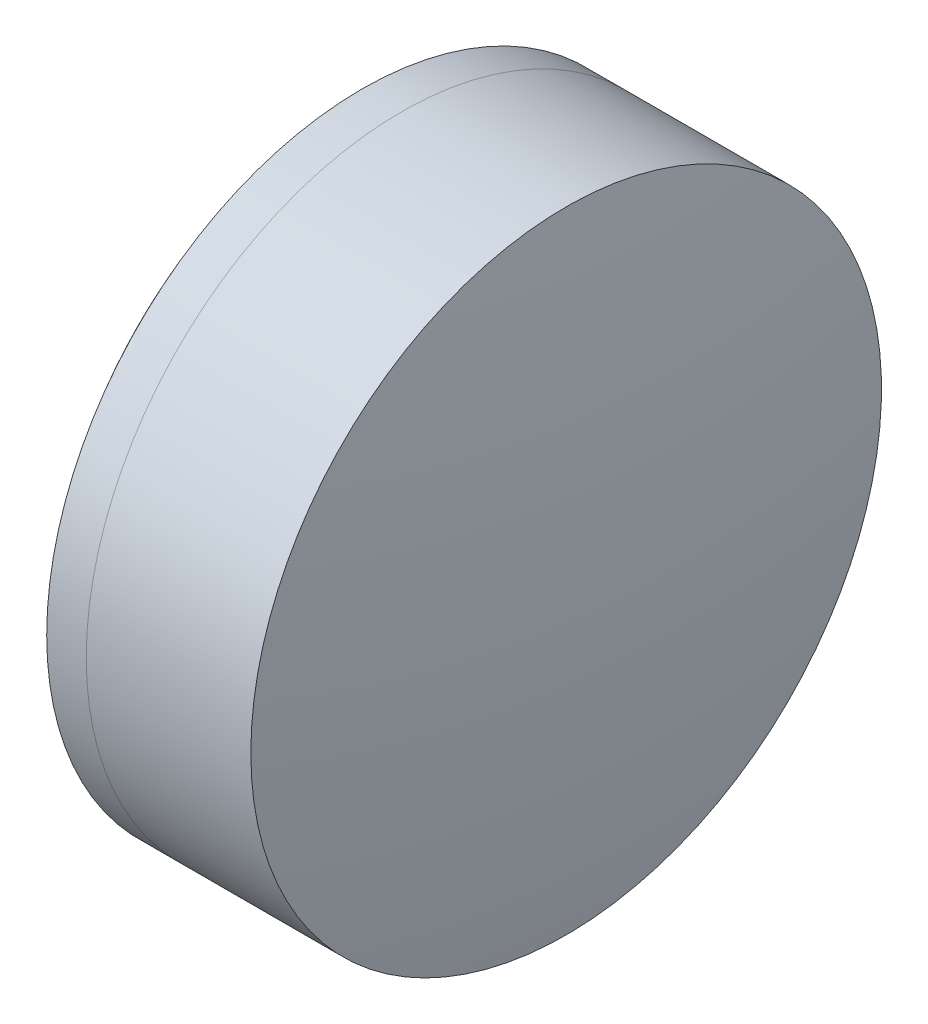
ISO-10303-21;
HEADER;
FILE_DESCRIPTION(('STEP AP214'),'2;1');
FILE_NAME('part.step','',(''),(''),'','','');
FILE_SCHEMA(('AUTOMOTIVE_DESIGN { 1 0 10303 214 1 1 1 1 }'));
ENDSEC;
DATA;
#1=APPLICATION_CONTEXT('core data for automotive mechanical design processes');
#2=APPLICATION_PROTOCOL_DEFINITION('international standard','automotive_design',2000,#1);
#3=PRODUCT_CONTEXT('',#1,'mechanical');
#4=PRODUCT('Part','Part','',(#3));
#5=PRODUCT_RELATED_PRODUCT_CATEGORY('part','',(#4));
#6=PRODUCT_DEFINITION_FORMATION('','',#4);
#7=PRODUCT_DEFINITION_CONTEXT('part definition',#1,'design');
#8=PRODUCT_DEFINITION('design','',#6,#7);
#9=PRODUCT_DEFINITION_SHAPE('','',#8);
#10=(LENGTH_UNIT() NAMED_UNIT(*) SI_UNIT(.MILLI.,.METRE.));
#11=(NAMED_UNIT(*) PLANE_ANGLE_UNIT() SI_UNIT($,.RADIAN.));
#12=(NAMED_UNIT(*) SI_UNIT($,.STERADIAN.) SOLID_ANGLE_UNIT());
#13=UNCERTAINTY_MEASURE_WITH_UNIT(LENGTH_MEASURE(1.E-05),#10,'distance_accuracy_value','');
#14=(GEOMETRIC_REPRESENTATION_CONTEXT(3) GLOBAL_UNCERTAINTY_ASSIGNED_CONTEXT((#13)) GLOBAL_UNIT_ASSIGNED_CONTEXT((#10,
#11,#12)) REPRESENTATION_CONTEXT('',''));
#15=CARTESIAN_POINT('',(0.,0.,0.));
#16=DIRECTION('',(0.,0.,1.));
#17=DIRECTION('',(1.,0.,0.));
#18=AXIS2_PLACEMENT_3D('',#15,#16,#17);
#19=CARTESIAN_POINT('',(264.478986554565,0.,0.));
#20=DIRECTION('',(-1.,0.,0.));
#21=DIRECTION('',(0.,0.,1.));
#22=AXIS2_PLACEMENT_3D('',#19,#20,#21);
#23=SPHERICAL_SURFACE('',#22,16.18);
#24=CARTESIAN_POINT('',(274.504075082853,0.,0.));
#25=DIRECTION('',(-1.,0.,0.));
#26=DIRECTION('',(0.,0.,1.));
#27=AXIS2_PLACEMENT_3D('',#24,#25,#26);
#28=CIRCLE('',#27,12.7);
#29=CARTESIAN_POINT('',(274.504075082853,0.,12.7));
#30=VERTEX_POINT('',#29);
#31=EDGE_CURVE('E11',#30,#30,#28,.T.);
#32=ORIENTED_EDGE('',*,*,#31,.T.);
#33=EDGE_LOOP('',(#32));
#34=FACE_BOUND('',#33,.T.);
#35=ADVANCED_FACE('F45',(#34),#23,.F.);
#36=CARTESIAN_POINT('',(-0.551919992657797,0.,0.));
#37=DIRECTION('',(-1.,0.,0.));
#38=DIRECTION('',(0.,0.,1.));
#39=AXIS2_PLACEMENT_3D('',#36,#37,#38);
#40=CYLINDRICAL_SURFACE('',#39,12.7);
#41=CARTESIAN_POINT('',(281.132534840341,0.,0.));
#42=DIRECTION('',(-1.,0.,0.));
#43=DIRECTION('',(0.,0.,1.));
#44=AXIS2_PLACEMENT_3D('',#41,#42,#43);
#45=CIRCLE('',#44,12.7);
#46=CARTESIAN_POINT('',(281.132534840341,0.,12.7));
#47=VERTEX_POINT('',#46);
#48=EDGE_CURVE('E51',#47,#47,#45,.T.);
#49=ORIENTED_EDGE('',*,*,#48,.T.);
#50=EDGE_LOOP('',(#49));
#51=FACE_BOUND('',#50,.T.);
#52=ORIENTED_EDGE('',*,*,#31,.F.);
#53=EDGE_LOOP('',(#52));
#54=FACE_BOUND('',#53,.T.);
#55=ADVANCED_FACE('F57',(#51,#54),#40,.T.);
#56=CARTESIAN_POINT('',(203.078986554565,0.,0.));
#57=DIRECTION('',(-1.,0.,0.));
#58=DIRECTION('',(0.,0.,1.));
#59=AXIS2_PLACEMENT_3D('',#56,#57,#58);
#60=SPHERICAL_SURFACE('',#59,79.08);
#61=ORIENTED_EDGE('',*,*,#48,.F.);
#62=EDGE_LOOP('',(#61));
#63=FACE_BOUND('',#62,.T.);
#64=ADVANCED_FACE('F60',(#63),#60,.T.);
#65=CLOSED_SHELL('',(#35,#55,#64));
#66=MANIFOLD_SOLID_BREP('B2',#65);
#67=CARTESIAN_POINT('',(289.748986554565,0.,0.));
#68=DIRECTION('',(-1.,0.,0.));
#69=DIRECTION('',(0.,0.,-1.));
#70=AXIS2_PLACEMENT_3D('',#67,#68,#69);
#71=SPHERICAL_SURFACE('',#70,21.09);
#72=CARTESIAN_POINT('',(272.911584735995,0.,0.));
#73=DIRECTION('',(-1.,0.,0.));
#74=DIRECTION('',(0.,0.,1.));
#75=AXIS2_PLACEMENT_3D('',#72,#73,#74);
#76=CIRCLE('',#75,12.7);
#77=CARTESIAN_POINT('',(272.911584735995,0.,12.7));
#78=VERTEX_POINT('',#77);
#79=EDGE_CURVE('E44',#78,#78,#76,.T.);
#80=ORIENTED_EDGE('',*,*,#79,.T.);
#81=EDGE_LOOP('',(#80));
#82=FACE_BOUND('',#81,.T.);
#83=ADVANCED_FACE('F86',(#82),#71,.T.);
#84=CARTESIAN_POINT('',(124.523309526045,0.,0.));
#85=DIRECTION('',(-1.,0.,0.));
#86=DIRECTION('',(0.,0.,1.));
#87=AXIS2_PLACEMENT_3D('',#84,#85,#86);
#88=CYLINDRICAL_SURFACE('',#87,12.7);
#89=CARTESIAN_POINT('',(274.504075082853,0.,0.));
#90=DIRECTION('',(-1.,0.,0.));
#91=DIRECTION('',(0.,0.,1.));
#92=AXIS2_PLACEMENT_3D('',#89,#90,#91);
#93=CIRCLE('',#92,12.7);
#94=CARTESIAN_POINT('',(274.504075082853,0.,12.7));
#95=VERTEX_POINT('',#94);
#96=EDGE_CURVE('E92',#95,#95,#93,.T.);
#97=ORIENTED_EDGE('',*,*,#96,.T.);
#98=EDGE_LOOP('',(#97));
#99=FACE_BOUND('',#98,.T.);
#100=ORIENTED_EDGE('',*,*,#79,.F.);
#101=EDGE_LOOP('',(#100));
#102=FACE_BOUND('',#101,.T.);
#103=ADVANCED_FACE('F98',(#99,#102),#88,.T.);
#104=CARTESIAN_POINT('',(264.478986554565,0.,0.));
#105=DIRECTION('',(-1.,0.,0.));
#106=DIRECTION('',(0.,0.,1.));
#107=AXIS2_PLACEMENT_3D('',#104,#105,#106);
#108=SPHERICAL_SURFACE('',#107,16.18);
#109=ORIENTED_EDGE('',*,*,#96,.F.);
#110=EDGE_LOOP('',(#109));
#111=FACE_BOUND('',#110,.T.);
#112=ADVANCED_FACE('F101',(#111),#108,.T.);
#113=CLOSED_SHELL('',(#83,#103,#112));
#114=MANIFOLD_SOLID_BREP('B6',#113);
#115=ADVANCED_BREP_SHAPE_REPRESENTATION('',(#18,#66,#114),#14);
#116=SHAPE_DEFINITION_REPRESENTATION(#9,#115);
ENDSEC;
END-ISO-10303-21;
